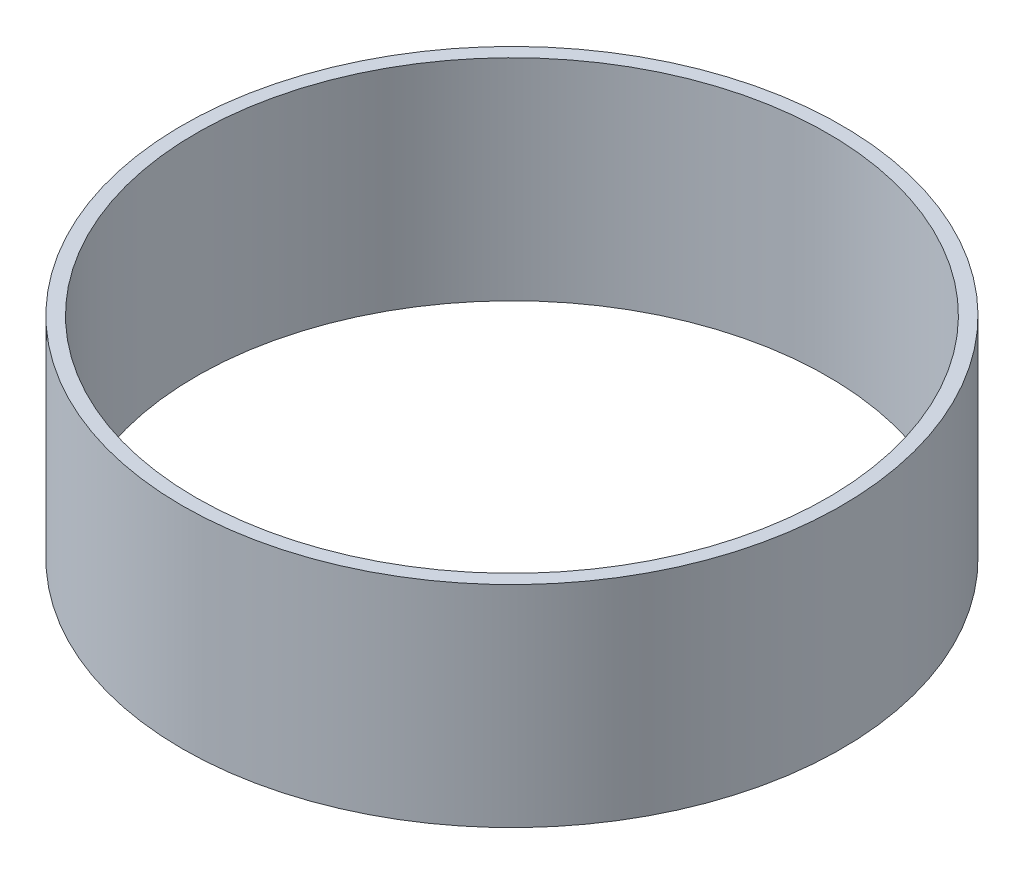
ISO-10303-21;
HEADER;
FILE_DESCRIPTION(('STEP AP214'),'2;1');
FILE_NAME('part.step','',(''),(''),'','','');
FILE_SCHEMA(('AUTOMOTIVE_DESIGN { 1 0 10303 214 1 1 1 1 }'));
ENDSEC;
DATA;
#1=APPLICATION_CONTEXT('core data for automotive mechanical design processes');
#2=APPLICATION_PROTOCOL_DEFINITION('international standard','automotive_design',2000,#1);
#3=PRODUCT_CONTEXT('',#1,'mechanical');
#4=PRODUCT('Part','Part','',(#3));
#5=PRODUCT_RELATED_PRODUCT_CATEGORY('part','',(#4));
#6=PRODUCT_DEFINITION_FORMATION('','',#4);
#7=PRODUCT_DEFINITION_CONTEXT('part definition',#1,'design');
#8=PRODUCT_DEFINITION('design','',#6,#7);
#9=PRODUCT_DEFINITION_SHAPE('','',#8);
#10=(LENGTH_UNIT() NAMED_UNIT(*) SI_UNIT(.MILLI.,.METRE.));
#11=(NAMED_UNIT(*) PLANE_ANGLE_UNIT() SI_UNIT($,.RADIAN.));
#12=(NAMED_UNIT(*) SI_UNIT($,.STERADIAN.) SOLID_ANGLE_UNIT());
#13=UNCERTAINTY_MEASURE_WITH_UNIT(LENGTH_MEASURE(1.E-05),#10,'distance_accuracy_value','');
#14=(GEOMETRIC_REPRESENTATION_CONTEXT(3) GLOBAL_UNCERTAINTY_ASSIGNED_CONTEXT((#13)) GLOBAL_UNIT_ASSIGNED_CONTEXT((#10,
#11,#12)) REPRESENTATION_CONTEXT('',''));
#15=CARTESIAN_POINT('',(0.,0.,0.));
#16=DIRECTION('',(0.,0.,1.));
#17=DIRECTION('',(1.,0.,0.));
#18=AXIS2_PLACEMENT_3D('',#15,#16,#17);
#19=CARTESIAN_POINT('',(0.,48.26,0.));
#20=DIRECTION('',(0.,1.,0.));
#21=DIRECTION('',(0.,0.,1.));
#22=AXIS2_PLACEMENT_3D('',#19,#20,#21);
#23=PLANE('',#22);
#24=CARTESIAN_POINT('',(0.,48.26,0.));
#25=DIRECTION('',(0.,1.,0.));
#26=DIRECTION('',(0.,0.,1.));
#27=AXIS2_PLACEMENT_3D('',#24,#25,#26);
#28=CIRCLE('',#27,75.565);
#29=CARTESIAN_POINT('',(0.,48.26,75.565));
#30=VERTEX_POINT('',#29);
#31=EDGE_CURVE('E10',#30,#30,#28,.T.);
#32=ORIENTED_EDGE('',*,*,#31,.T.);
#33=EDGE_LOOP('',(#32));
#34=FACE_BOUND('',#33,.T.);
#35=CARTESIAN_POINT('',(0.,48.26,0.));
#36=DIRECTION('',(0.,1.,0.));
#37=DIRECTION('',(0.,0.,1.));
#38=AXIS2_PLACEMENT_3D('',#35,#36,#37);
#39=CIRCLE('',#38,72.39);
#40=CARTESIAN_POINT('',(0.,48.26,72.39));
#41=VERTEX_POINT('',#40);
#42=EDGE_CURVE('E52',#41,#41,#39,.T.);
#43=ORIENTED_EDGE('',*,*,#42,.F.);
#44=EDGE_LOOP('',(#43));
#45=FACE_BOUND('',#44,.T.);
#46=ADVANCED_FACE('F39',(#34,#45),#23,.T.);
#47=CARTESIAN_POINT('',(0.,0.,0.));
#48=DIRECTION('',(0.,1.,0.));
#49=DIRECTION('',(0.,0.,1.));
#50=AXIS2_PLACEMENT_3D('',#47,#48,#49);
#51=PLANE('',#50);
#52=CARTESIAN_POINT('',(0.,0.,0.));
#53=DIRECTION('',(0.,1.,0.));
#54=DIRECTION('',(0.,0.,1.));
#55=AXIS2_PLACEMENT_3D('',#52,#53,#54);
#56=CIRCLE('',#55,75.565);
#57=CARTESIAN_POINT('',(0.,0.,75.565));
#58=VERTEX_POINT('',#57);
#59=EDGE_CURVE('E43',#58,#58,#56,.T.);
#60=ORIENTED_EDGE('',*,*,#59,.F.);
#61=EDGE_LOOP('',(#60));
#62=FACE_BOUND('',#61,.T.);
#63=CARTESIAN_POINT('',(0.,0.,0.));
#64=DIRECTION('',(0.,1.,0.));
#65=DIRECTION('',(0.,0.,1.));
#66=AXIS2_PLACEMENT_3D('',#63,#64,#65);
#67=CIRCLE('',#66,72.39);
#68=CARTESIAN_POINT('',(0.,0.,72.39));
#69=VERTEX_POINT('',#68);
#70=EDGE_CURVE('E54',#69,#69,#67,.T.);
#71=ORIENTED_EDGE('',*,*,#70,.T.);
#72=EDGE_LOOP('',(#71));
#73=FACE_BOUND('',#72,.T.);
#74=ADVANCED_FACE('F66',(#62,#73),#51,.F.);
#75=CARTESIAN_POINT('',(0.,48.26,0.));
#76=DIRECTION('',(0.,-1.,0.));
#77=DIRECTION('',(0.,0.,-1.));
#78=AXIS2_PLACEMENT_3D('',#75,#76,#77);
#79=CYLINDRICAL_SURFACE('',#78,75.565);
#80=ORIENTED_EDGE('',*,*,#31,.F.);
#81=EDGE_LOOP('',(#80));
#82=FACE_BOUND('',#81,.T.);
#83=ORIENTED_EDGE('',*,*,#59,.T.);
#84=EDGE_LOOP('',(#83));
#85=FACE_BOUND('',#84,.T.);
#86=ADVANCED_FACE('F41',(#82,#85),#79,.T.);
#87=CARTESIAN_POINT('',(0.,48.26,0.));
#88=DIRECTION('',(0.,-1.,0.));
#89=DIRECTION('',(0.,0.,-1.));
#90=AXIS2_PLACEMENT_3D('',#87,#88,#89);
#91=CYLINDRICAL_SURFACE('',#90,72.39);
#92=ORIENTED_EDGE('',*,*,#42,.T.);
#93=EDGE_LOOP('',(#92));
#94=FACE_BOUND('',#93,.T.);
#95=ORIENTED_EDGE('',*,*,#70,.F.);
#96=EDGE_LOOP('',(#95));
#97=FACE_BOUND('',#96,.T.);
#98=ADVANCED_FACE('F62',(#94,#97),#91,.F.);
#99=CLOSED_SHELL('',(#46,#74,#86,#98));
#100=MANIFOLD_SOLID_BREP('B2',#99);
#101=ADVANCED_BREP_SHAPE_REPRESENTATION('',(#18,#100),#14);
#102=SHAPE_DEFINITION_REPRESENTATION(#9,#101);
ENDSEC;
END-ISO-10303-21;
